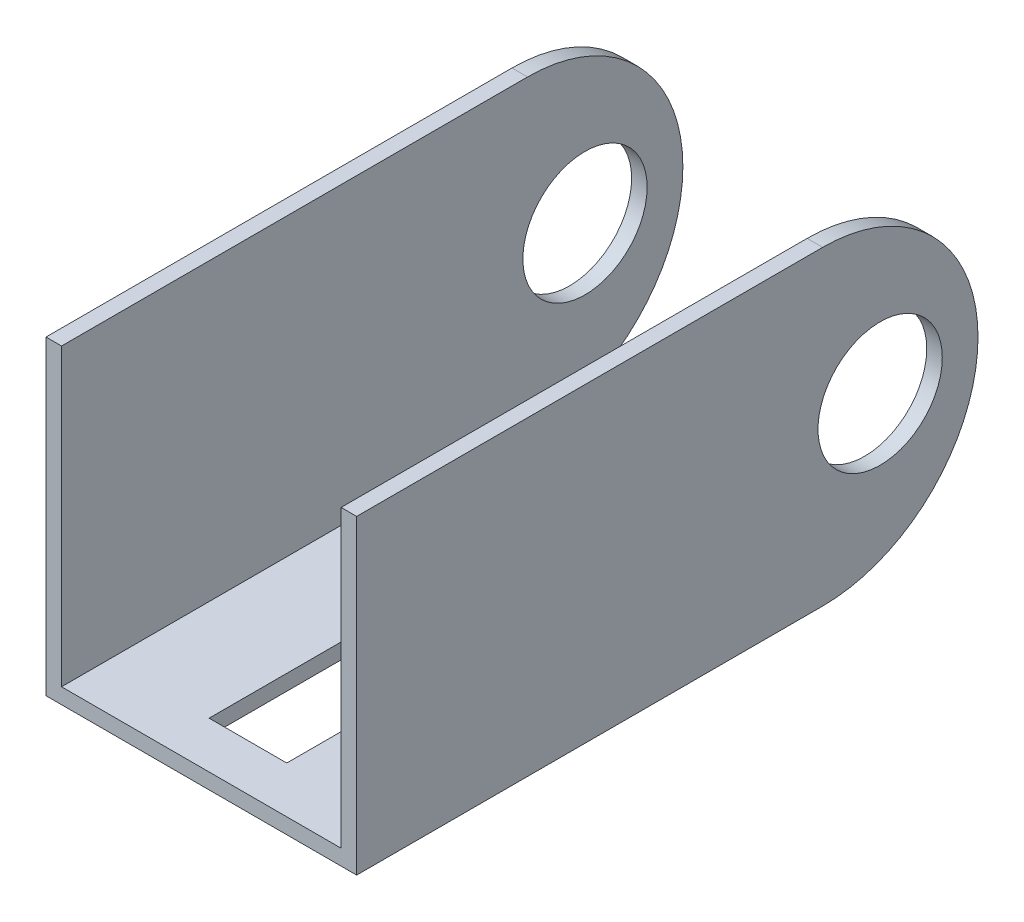
ISO-10303-21;
HEADER;
FILE_DESCRIPTION(('STEP AP214'),'2;1');
FILE_NAME('part.step','',(''),(''),'','','');
FILE_SCHEMA(('AUTOMOTIVE_DESIGN { 1 0 10303 214 1 1 1 1 }'));
ENDSEC;
DATA;
#1=APPLICATION_CONTEXT('core data for automotive mechanical design processes');
#2=APPLICATION_PROTOCOL_DEFINITION('international standard','automotive_design',2000,#1);
#3=PRODUCT_CONTEXT('',#1,'mechanical');
#4=PRODUCT('Part','Part','',(#3));
#5=PRODUCT_RELATED_PRODUCT_CATEGORY('part','',(#4));
#6=PRODUCT_DEFINITION_FORMATION('','',#4);
#7=PRODUCT_DEFINITION_CONTEXT('part definition',#1,'design');
#8=PRODUCT_DEFINITION('design','',#6,#7);
#9=PRODUCT_DEFINITION_SHAPE('','',#8);
#10=(LENGTH_UNIT() NAMED_UNIT(*) SI_UNIT(.MILLI.,.METRE.));
#11=(NAMED_UNIT(*) PLANE_ANGLE_UNIT() SI_UNIT($,.RADIAN.));
#12=(NAMED_UNIT(*) SI_UNIT($,.STERADIAN.) SOLID_ANGLE_UNIT());
#13=UNCERTAINTY_MEASURE_WITH_UNIT(LENGTH_MEASURE(1.E-05),#10,'distance_accuracy_value','');
#14=(GEOMETRIC_REPRESENTATION_CONTEXT(3) GLOBAL_UNCERTAINTY_ASSIGNED_CONTEXT((#13)) GLOBAL_UNIT_ASSIGNED_CONTEXT((#10,
#11,#12)) REPRESENTATION_CONTEXT('',''));
#15=CARTESIAN_POINT('',(0.,0.,0.));
#16=DIRECTION('',(0.,0.,1.));
#17=DIRECTION('',(1.,0.,0.));
#18=AXIS2_PLACEMENT_3D('',#15,#16,#17);
#19=CARTESIAN_POINT('',(-40.,10.,-30.));
#20=DIRECTION('',(1.,0.,0.));
#21=DIRECTION('',(0.,0.,-1.));
#22=AXIS2_PLACEMENT_3D('',#19,#20,#21);
#23=CYLINDRICAL_SURFACE('',#22,10.);
#24=CARTESIAN_POINT('',(-19.,10.,-30.));
#25=DIRECTION('',(1.,0.,0.));
#26=DIRECTION('',(0.,0.,-1.));
#27=AXIS2_PLACEMENT_3D('',#24,#25,#26);
#28=CIRCLE('',#27,10.);
#29=CARTESIAN_POINT('',(-19.,0.,-30.));
#30=VERTEX_POINT('',#29);
#31=CARTESIAN_POINT('',(-19.,20.,-30.));
#32=VERTEX_POINT('',#31);
#33=EDGE_CURVE('E238',#30,#32,#28,.T.);
#34=ORIENTED_EDGE('',*,*,#33,.F.);
#35=DIRECTION('',(1.,0.,0.));
#36=VECTOR('',#35,1.);
#37=CARTESIAN_POINT('',(-40.,0.,-30.));
#38=LINE('',#37,#36);
#39=CARTESIAN_POINT('',(-20.,0.,-30.));
#40=VERTEX_POINT('',#39);
#41=EDGE_CURVE('E226',#40,#30,#38,.T.);
#42=ORIENTED_EDGE('',*,*,#41,.F.);
#43=CARTESIAN_POINT('',(-20.,10.,-30.));
#44=DIRECTION('',(-1.,0.,0.));
#45=DIRECTION('',(0.,0.,1.));
#46=AXIS2_PLACEMENT_3D('',#43,#44,#45);
#47=CIRCLE('',#46,10.);
#48=CARTESIAN_POINT('',(-20.,20.,-30.));
#49=VERTEX_POINT('',#48);
#50=EDGE_CURVE('E241',#49,#40,#47,.T.);
#51=ORIENTED_EDGE('',*,*,#50,.F.);
#52=DIRECTION('',(1.,0.,0.));
#53=VECTOR('',#52,1.);
#54=CARTESIAN_POINT('',(-40.,20.,-30.));
#55=LINE('',#54,#53);
#56=EDGE_CURVE('E237',#49,#32,#55,.T.);
#57=ORIENTED_EDGE('',*,*,#56,.T.);
#58=EDGE_LOOP('',(#34,#42,#51,#57));
#59=FACE_BOUND('',#58,.T.);
#60=ADVANCED_FACE('F58',(#59),#23,.T.);
#61=CARTESIAN_POINT('',(-1.,0.999999999999998,-40.));
#62=DIRECTION('',(-1.,0.,0.));
#63=DIRECTION('',(0.,0.,1.));
#64=AXIS2_PLACEMENT_3D('',#61,#62,#63);
#65=PLANE('',#64);
#66=CARTESIAN_POINT('',(-1.,10.,-33.7));
#67=DIRECTION('',(-1.,0.,0.));
#68=DIRECTION('',(0.,0.,1.));
#69=AXIS2_PLACEMENT_3D('',#66,#67,#68);
#70=CIRCLE('',#69,4.);
#71=CARTESIAN_POINT('',(-1.,10.,-29.7));
#72=VERTEX_POINT('',#71);
#73=EDGE_CURVE('E221',#72,#72,#70,.T.);
#74=ORIENTED_EDGE('',*,*,#73,.F.);
#75=EDGE_LOOP('',(#74));
#76=FACE_BOUND('',#75,.T.);
#77=CARTESIAN_POINT('',(-1.,10.,-30.));
#78=DIRECTION('',(-1.,0.,0.));
#79=DIRECTION('',(0.,0.,1.));
#80=AXIS2_PLACEMENT_3D('',#77,#78,#79);
#81=CIRCLE('',#80,10.);
#82=CARTESIAN_POINT('',(-1.,20.,-30.));
#83=VERTEX_POINT('',#82);
#84=CARTESIAN_POINT('',(-1.,0.,-30.));
#85=VERTEX_POINT('',#84);
#86=EDGE_CURVE('E244',#83,#85,#81,.T.);
#87=ORIENTED_EDGE('',*,*,#86,.T.);
#88=DIRECTION('',(0.,0.,1.));
#89=VECTOR('',#88,1.);
#90=CARTESIAN_POINT('',(-1.,0.,-34.3588989435407));
#91=LINE('',#90,#89);
#92=CARTESIAN_POINT('',(-1.,0.,-26.));
#93=VERTEX_POINT('',#92);
#94=EDGE_CURVE('E198',#85,#93,#91,.T.);
#95=ORIENTED_EDGE('',*,*,#94,.T.);
#96=DIRECTION('',(0.,-1.,0.));
#97=VECTOR('',#96,1.);
#98=CARTESIAN_POINT('',(-1.00000000000001,40.,-26.));
#99=LINE('',#98,#97);
#100=CARTESIAN_POINT('',(-1.,1.,-26.));
#101=VERTEX_POINT('',#100);
#102=EDGE_CURVE('E206',#101,#93,#99,.T.);
#103=ORIENTED_EDGE('',*,*,#102,.F.);
#104=DIRECTION('',(0.,0.,1.));
#105=VECTOR('',#104,1.);
#106=CARTESIAN_POINT('',(-1.,0.999999999999998,-40.));
#107=LINE('',#106,#105);
#108=CARTESIAN_POINT('',(-1.,0.999999999999998,0.));
#109=VERTEX_POINT('',#108);
#110=EDGE_CURVE('E279',#101,#109,#107,.T.);
#111=ORIENTED_EDGE('',*,*,#110,.T.);
#112=DIRECTION('',(0.,-1.,0.));
#113=VECTOR('',#112,1.);
#114=CARTESIAN_POINT('',(-1.,0.999999999999998,0.));
#115=LINE('',#114,#113);
#116=CARTESIAN_POINT('',(-1.,20.,0.));
#117=VERTEX_POINT('',#116);
#118=EDGE_CURVE('E247',#117,#109,#115,.T.);
#119=ORIENTED_EDGE('',*,*,#118,.F.);
#120=DIRECTION('',(0.,0.,1.));
#121=VECTOR('',#120,1.);
#122=CARTESIAN_POINT('',(-1.,20.,-40.));
#123=LINE('',#122,#121);
#124=EDGE_CURVE('E280',#83,#117,#123,.T.);
#125=ORIENTED_EDGE('',*,*,#124,.F.);
#126=EDGE_LOOP('',(#87,#95,#103,#111,#119,#125));
#127=FACE_BOUND('',#126,.T.);
#128=ADVANCED_FACE('F60',(#76,#127),#65,.T.);
#129=CARTESIAN_POINT('',(0.,20.,-40.));
#130=DIRECTION('',(1.,0.,0.));
#131=DIRECTION('',(0.,0.,-1.));
#132=AXIS2_PLACEMENT_3D('',#129,#130,#131);
#133=PLANE('',#132);
#134=CARTESIAN_POINT('',(0.,10.,-33.7));
#135=DIRECTION('',(1.,0.,0.));
#136=DIRECTION('',(0.,0.,-1.));
#137=AXIS2_PLACEMENT_3D('',#134,#135,#136);
#138=CIRCLE('',#137,4.);
#139=CARTESIAN_POINT('',(0.,10.,-37.7));
#140=VERTEX_POINT('',#139);
#141=EDGE_CURVE('E210',#140,#140,#138,.T.);
#142=ORIENTED_EDGE('',*,*,#141,.F.);
#143=EDGE_LOOP('',(#142));
#144=FACE_BOUND('',#143,.T.);
#145=DIRECTION('',(0.,0.,1.));
#146=VECTOR('',#145,1.);
#147=CARTESIAN_POINT('',(0.,0.,-40.));
#148=LINE('',#147,#146);
#149=CARTESIAN_POINT('',(0.,0.,-30.));
#150=VERTEX_POINT('',#149);
#151=CARTESIAN_POINT('',(0.,0.,0.));
#152=VERTEX_POINT('',#151);
#153=EDGE_CURVE('E287',#150,#152,#148,.T.);
#154=ORIENTED_EDGE('',*,*,#153,.F.);
#155=CARTESIAN_POINT('',(0.,10.,-30.));
#156=DIRECTION('',(1.,0.,0.));
#157=DIRECTION('',(0.,0.,-1.));
#158=AXIS2_PLACEMENT_3D('',#155,#156,#157);
#159=CIRCLE('',#158,10.);
#160=CARTESIAN_POINT('',(0.,20.,-30.));
#161=VERTEX_POINT('',#160);
#162=EDGE_CURVE('E230',#150,#161,#159,.T.);
#163=ORIENTED_EDGE('',*,*,#162,.T.);
#164=DIRECTION('',(0.,0.,1.));
#165=VECTOR('',#164,1.);
#166=CARTESIAN_POINT('',(0.,20.,-40.));
#167=LINE('',#166,#165);
#168=CARTESIAN_POINT('',(0.,20.,0.));
#169=VERTEX_POINT('',#168);
#170=EDGE_CURVE('E284',#161,#169,#167,.T.);
#171=ORIENTED_EDGE('',*,*,#170,.T.);
#172=DIRECTION('',(0.,1.,0.));
#173=VECTOR('',#172,1.);
#174=CARTESIAN_POINT('',(0.,20.,0.));
#175=LINE('',#174,#173);
#176=EDGE_CURVE('E271',#152,#169,#175,.T.);
#177=ORIENTED_EDGE('',*,*,#176,.F.);
#178=EDGE_LOOP('',(#154,#163,#171,#177));
#179=FACE_BOUND('',#178,.T.);
#180=ADVANCED_FACE('F343',(#144,#179),#133,.T.);
#181=CARTESIAN_POINT('',(-20.,0.,-40.));
#182=DIRECTION('',(-1.,0.,0.));
#183=DIRECTION('',(0.,0.,1.));
#184=AXIS2_PLACEMENT_3D('',#181,#182,#183);
#185=PLANE('',#184);
#186=CARTESIAN_POINT('',(-20.,10.,-33.7));
#187=DIRECTION('',(-1.,0.,0.));
#188=DIRECTION('',(0.,0.,1.));
#189=AXIS2_PLACEMENT_3D('',#186,#187,#188);
#190=CIRCLE('',#189,4.);
#191=CARTESIAN_POINT('',(-20.,10.,-29.7));
#192=VERTEX_POINT('',#191);
#193=EDGE_CURVE('E217',#192,#192,#190,.T.);
#194=ORIENTED_EDGE('',*,*,#193,.F.);
#195=EDGE_LOOP('',(#194));
#196=FACE_BOUND('',#195,.T.);
#197=ORIENTED_EDGE('',*,*,#50,.T.);
#198=DIRECTION('',(0.,0.,1.));
#199=VECTOR('',#198,1.);
#200=CARTESIAN_POINT('',(-20.,0.,-40.));
#201=LINE('',#200,#199);
#202=CARTESIAN_POINT('',(-20.,0.,0.));
#203=VERTEX_POINT('',#202);
#204=EDGE_CURVE('E290',#40,#203,#201,.T.);
#205=ORIENTED_EDGE('',*,*,#204,.T.);
#206=DIRECTION('',(0.,-1.,0.));
#207=VECTOR('',#206,1.);
#208=CARTESIAN_POINT('',(-20.,0.,0.));
#209=LINE('',#208,#207);
#210=CARTESIAN_POINT('',(-20.,20.,0.));
#211=VERTEX_POINT('',#210);
#212=EDGE_CURVE('E263',#211,#203,#209,.T.);
#213=ORIENTED_EDGE('',*,*,#212,.F.);
#214=DIRECTION('',(0.,0.,1.));
#215=VECTOR('',#214,1.);
#216=CARTESIAN_POINT('',(-20.,20.,-40.));
#217=LINE('',#216,#215);
#218=EDGE_CURVE('E293',#49,#211,#217,.T.);
#219=ORIENTED_EDGE('',*,*,#218,.F.);
#220=EDGE_LOOP('',(#197,#205,#213,#219));
#221=FACE_BOUND('',#220,.T.);
#222=ADVANCED_FACE('F382',(#196,#221),#185,.T.);
#223=CARTESIAN_POINT('',(-19.,20.,-40.));
#224=DIRECTION('',(1.,0.,0.));
#225=DIRECTION('',(0.,0.,-1.));
#226=AXIS2_PLACEMENT_3D('',#223,#224,#225);
#227=PLANE('',#226);
#228=CARTESIAN_POINT('',(-19.,10.,-33.7));
#229=DIRECTION('',(1.,0.,0.));
#230=DIRECTION('',(0.,0.,-1.));
#231=AXIS2_PLACEMENT_3D('',#228,#229,#230);
#232=CIRCLE('',#231,4.);
#233=CARTESIAN_POINT('',(-19.,10.,-37.7));
#234=VERTEX_POINT('',#233);
#235=EDGE_CURVE('E216',#234,#234,#232,.T.);
#236=ORIENTED_EDGE('',*,*,#235,.F.);
#237=EDGE_LOOP('',(#236));
#238=FACE_BOUND('',#237,.T.);
#239=DIRECTION('',(0.,0.,-1.));
#240=VECTOR('',#239,1.);
#241=CARTESIAN_POINT('',(-19.,0.,-26.));
#242=LINE('',#241,#240);
#243=CARTESIAN_POINT('',(-19.,0.,-26.));
#244=VERTEX_POINT('',#243);
#245=EDGE_CURVE('E190',#244,#30,#242,.T.);
#246=ORIENTED_EDGE('',*,*,#245,.T.);
#247=ORIENTED_EDGE('',*,*,#33,.T.);
#248=DIRECTION('',(0.,0.,1.));
#249=VECTOR('',#248,1.);
#250=CARTESIAN_POINT('',(-19.,20.,-40.));
#251=LINE('',#250,#249);
#252=CARTESIAN_POINT('',(-19.,20.,0.));
#253=VERTEX_POINT('',#252);
#254=EDGE_CURVE('E296',#32,#253,#251,.T.);
#255=ORIENTED_EDGE('',*,*,#254,.T.);
#256=DIRECTION('',(0.,1.,0.));
#257=VECTOR('',#256,1.);
#258=CARTESIAN_POINT('',(-19.,20.,0.));
#259=LINE('',#258,#257);
#260=CARTESIAN_POINT('',(-19.,0.999999999999997,0.));
#261=VERTEX_POINT('',#260);
#262=EDGE_CURVE('E255',#261,#253,#259,.T.);
#263=ORIENTED_EDGE('',*,*,#262,.F.);
#264=DIRECTION('',(0.,0.,1.));
#265=VECTOR('',#264,1.);
#266=CARTESIAN_POINT('',(-19.,0.999999999999997,-40.));
#267=LINE('',#266,#265);
#268=CARTESIAN_POINT('',(-19.,1.,-26.));
#269=VERTEX_POINT('',#268);
#270=EDGE_CURVE('E299',#269,#261,#267,.T.);
#271=ORIENTED_EDGE('',*,*,#270,.F.);
#272=DIRECTION('',(0.,-1.,0.));
#273=VECTOR('',#272,1.);
#274=CARTESIAN_POINT('',(-19.,40.,-26.));
#275=LINE('',#274,#273);
#276=EDGE_CURVE('E207',#269,#244,#275,.T.);
#277=ORIENTED_EDGE('',*,*,#276,.T.);
#278=EDGE_LOOP('',(#246,#247,#255,#263,#271,#277));
#279=FACE_BOUND('',#278,.T.);
#280=ADVANCED_FACE('F374',(#238,#279),#227,.T.);
#281=CARTESIAN_POINT('',(0.,0.,-40.));
#282=DIRECTION('',(0.,-1.,0.));
#283=DIRECTION('',(1.,0.,0.));
#284=AXIS2_PLACEMENT_3D('',#281,#282,#283);
#285=PLANE('',#284);
#286=DIRECTION('',(0.,0.,1.));
#287=VECTOR('',#286,1.);
#288=CARTESIAN_POINT('',(-7.5,0.,-22.));
#289=LINE('',#288,#287);
#290=CARTESIAN_POINT('',(-7.5,0.,-22.));
#291=VERTEX_POINT('',#290);
#292=CARTESIAN_POINT('',(-7.5,0.,-3.));
#293=VERTEX_POINT('',#292);
#294=EDGE_CURVE('E74',#291,#293,#289,.T.);
#295=ORIENTED_EDGE('',*,*,#294,.F.);
#296=DIRECTION('',(1.,0.,0.));
#297=VECTOR('',#296,1.);
#298=CARTESIAN_POINT('',(-7.5,0.,-22.));
#299=LINE('',#298,#297);
#300=CARTESIAN_POINT('',(-12.5,0.,-22.));
#301=VERTEX_POINT('',#300);
#302=EDGE_CURVE('E180',#301,#291,#299,.T.);
#303=ORIENTED_EDGE('',*,*,#302,.F.);
#304=DIRECTION('',(0.,0.,-1.));
#305=VECTOR('',#304,1.);
#306=CARTESIAN_POINT('',(-12.5,0.,-22.));
#307=LINE('',#306,#305);
#308=CARTESIAN_POINT('',(-12.5,0.,-3.));
#309=VERTEX_POINT('',#308);
#310=EDGE_CURVE('E162',#309,#301,#307,.T.);
#311=ORIENTED_EDGE('',*,*,#310,.F.);
#312=DIRECTION('',(-1.,0.,0.));
#313=VECTOR('',#312,1.);
#314=CARTESIAN_POINT('',(-7.5,0.,-3.));
#315=LINE('',#314,#313);
#316=EDGE_CURVE('E172',#293,#309,#315,.T.);
#317=ORIENTED_EDGE('',*,*,#316,.F.);
#318=EDGE_LOOP('',(#295,#303,#311,#317));
#319=FACE_BOUND('',#318,.T.);
#320=ORIENTED_EDGE('',*,*,#245,.F.);
#321=DIRECTION('',(-1.,0.,0.));
#322=VECTOR('',#321,1.);
#323=CARTESIAN_POINT('',(-19.,0.,-26.));
#324=LINE('',#323,#322);
#325=EDGE_CURVE('E202',#93,#244,#324,.T.);
#326=ORIENTED_EDGE('',*,*,#325,.F.);
#327=ORIENTED_EDGE('',*,*,#94,.F.);
#328=EDGE_CURVE('E225',#85,#150,#38,.T.);
#329=ORIENTED_EDGE('',*,*,#328,.T.);
#330=ORIENTED_EDGE('',*,*,#153,.T.);
#331=DIRECTION('',(1.,0.,0.));
#332=VECTOR('',#331,1.);
#333=CARTESIAN_POINT('',(0.,0.,0.));
#334=LINE('',#333,#332);
#335=EDGE_CURVE('E267',#203,#152,#334,.T.);
#336=ORIENTED_EDGE('',*,*,#335,.F.);
#337=ORIENTED_EDGE('',*,*,#204,.F.);
#338=ORIENTED_EDGE('',*,*,#41,.T.);
#339=EDGE_LOOP('',(#320,#326,#327,#329,#330,#336,#337,#338));
#340=FACE_BOUND('',#339,.T.);
#341=ADVANCED_FACE('F177',(#319,#340),#285,.T.);
#342=CARTESIAN_POINT('',(-19.,0.999999999999997,-40.));
#343=DIRECTION('',(0.,1.,0.));
#344=DIRECTION('',(-1.,0.,0.));
#345=AXIS2_PLACEMENT_3D('',#342,#343,#344);
#346=PLANE('',#345);
#347=DIRECTION('',(0.,0.,-1.));
#348=VECTOR('',#347,1.);
#349=CARTESIAN_POINT('',(-7.5,0.999999999999998,-40.));
#350=LINE('',#349,#348);
#351=CARTESIAN_POINT('',(-7.5,1.,-3.));
#352=VERTEX_POINT('',#351);
#353=CARTESIAN_POINT('',(-7.5,1.,-22.));
#354=VERTEX_POINT('',#353);
#355=EDGE_CURVE('E12',#352,#354,#350,.T.);
#356=ORIENTED_EDGE('',*,*,#355,.F.);
#357=DIRECTION('',(1.,0.,0.));
#358=VECTOR('',#357,1.);
#359=CARTESIAN_POINT('',(-19.,0.999999999999997,-3.));
#360=LINE('',#359,#358);
#361=CARTESIAN_POINT('',(-12.5,0.999999999999998,-3.));
#362=VERTEX_POINT('',#361);
#363=EDGE_CURVE('E309',#362,#352,#360,.T.);
#364=ORIENTED_EDGE('',*,*,#363,.F.);
#365=DIRECTION('',(0.,0.,1.));
#366=VECTOR('',#365,1.);
#367=CARTESIAN_POINT('',(-12.5,0.999999999999998,-40.));
#368=LINE('',#367,#366);
#369=CARTESIAN_POINT('',(-12.5,1.,-22.));
#370=VERTEX_POINT('',#369);
#371=EDGE_CURVE('E165',#370,#362,#368,.T.);
#372=ORIENTED_EDGE('',*,*,#371,.F.);
#373=DIRECTION('',(-1.,0.,0.));
#374=VECTOR('',#373,1.);
#375=CARTESIAN_POINT('',(-19.,0.999999999999997,-22.));
#376=LINE('',#375,#374);
#377=EDGE_CURVE('E67',#354,#370,#376,.T.);
#378=ORIENTED_EDGE('',*,*,#377,.F.);
#379=EDGE_LOOP('',(#356,#364,#372,#378));
#380=FACE_BOUND('',#379,.T.);
#381=DIRECTION('',(1.,0.,0.));
#382=VECTOR('',#381,1.);
#383=CARTESIAN_POINT('',(-19.,0.999999999999997,-26.));
#384=LINE('',#383,#382);
#385=EDGE_CURVE('E283',#269,#101,#384,.T.);
#386=ORIENTED_EDGE('',*,*,#385,.F.);
#387=ORIENTED_EDGE('',*,*,#270,.T.);
#388=DIRECTION('',(-1.,0.,0.));
#389=VECTOR('',#388,1.);
#390=CARTESIAN_POINT('',(-19.,0.999999999999997,0.));
#391=LINE('',#390,#389);
#392=EDGE_CURVE('E251',#109,#261,#391,.T.);
#393=ORIENTED_EDGE('',*,*,#392,.F.);
#394=ORIENTED_EDGE('',*,*,#110,.F.);
#395=EDGE_LOOP('',(#386,#387,#393,#394));
#396=FACE_BOUND('',#395,.T.);
#397=ADVANCED_FACE('F320',(#380,#396),#346,.T.);
#398=CARTESIAN_POINT('',(-1.,20.,-40.));
#399=DIRECTION('',(0.,1.,0.));
#400=DIRECTION('',(0.,0.,1.));
#401=AXIS2_PLACEMENT_3D('',#398,#399,#400);
#402=PLANE('',#401);
#403=EDGE_CURVE('E234',#83,#161,#55,.T.);
#404=ORIENTED_EDGE('',*,*,#403,.F.);
#405=ORIENTED_EDGE('',*,*,#124,.T.);
#406=DIRECTION('',(-1.,0.,0.));
#407=VECTOR('',#406,1.);
#408=CARTESIAN_POINT('',(-1.,20.,0.));
#409=LINE('',#408,#407);
#410=EDGE_CURVE('E275',#169,#117,#409,.T.);
#411=ORIENTED_EDGE('',*,*,#410,.F.);
#412=ORIENTED_EDGE('',*,*,#170,.F.);
#413=EDGE_LOOP('',(#404,#405,#411,#412));
#414=FACE_BOUND('',#413,.T.);
#415=ADVANCED_FACE('F392',(#414),#402,.T.);
#416=CARTESIAN_POINT('',(-20.,20.,-40.));
#417=DIRECTION('',(0.,1.,0.));
#418=DIRECTION('',(0.,0.,1.));
#419=AXIS2_PLACEMENT_3D('',#416,#417,#418);
#420=PLANE('',#419);
#421=ORIENTED_EDGE('',*,*,#56,.F.);
#422=ORIENTED_EDGE('',*,*,#218,.T.);
#423=DIRECTION('',(-1.,0.,0.));
#424=VECTOR('',#423,1.);
#425=CARTESIAN_POINT('',(-20.,20.,0.));
#426=LINE('',#425,#424);
#427=EDGE_CURVE('E259',#253,#211,#426,.T.);
#428=ORIENTED_EDGE('',*,*,#427,.F.);
#429=ORIENTED_EDGE('',*,*,#254,.F.);
#430=EDGE_LOOP('',(#421,#422,#428,#429));
#431=FACE_BOUND('',#430,.T.);
#432=ADVANCED_FACE('F356',(#431),#420,.T.);
#433=CARTESIAN_POINT('',(0.,0.,0.));
#434=DIRECTION('',(0.,0.,-1.));
#435=DIRECTION('',(-1.,0.,0.));
#436=AXIS2_PLACEMENT_3D('',#433,#434,#435);
#437=PLANE('',#436);
#438=ORIENTED_EDGE('',*,*,#118,.T.);
#439=ORIENTED_EDGE('',*,*,#392,.T.);
#440=ORIENTED_EDGE('',*,*,#262,.T.);
#441=ORIENTED_EDGE('',*,*,#427,.T.);
#442=ORIENTED_EDGE('',*,*,#212,.T.);
#443=ORIENTED_EDGE('',*,*,#335,.T.);
#444=ORIENTED_EDGE('',*,*,#176,.T.);
#445=ORIENTED_EDGE('',*,*,#410,.T.);
#446=EDGE_LOOP('',(#438,#439,#440,#441,#442,#443,#444,#445));
#447=FACE_BOUND('',#446,.T.);
#448=ADVANCED_FACE('F349',(#447),#437,.F.);
#449=ORIENTED_EDGE('',*,*,#328,.F.);
#450=ORIENTED_EDGE('',*,*,#86,.F.);
#451=ORIENTED_EDGE('',*,*,#403,.T.);
#452=ORIENTED_EDGE('',*,*,#162,.F.);
#453=EDGE_LOOP('',(#449,#450,#451,#452));
#454=FACE_BOUND('',#453,.T.);
#455=ADVANCED_FACE('F339',(#454),#23,.T.);
#456=CARTESIAN_POINT('',(-40.,10.,-33.7));
#457=DIRECTION('',(1.,0.,0.));
#458=DIRECTION('',(0.,0.,-1.));
#459=AXIS2_PLACEMENT_3D('',#456,#457,#458);
#460=CYLINDRICAL_SURFACE('',#459,4.);
#461=ORIENTED_EDGE('',*,*,#193,.T.);
#462=EDGE_LOOP('',(#461));
#463=FACE_BOUND('',#462,.T.);
#464=ORIENTED_EDGE('',*,*,#235,.T.);
#465=EDGE_LOOP('',(#464));
#466=FACE_BOUND('',#465,.T.);
#467=ADVANCED_FACE('F348',(#463,#466),#460,.F.);
#468=ORIENTED_EDGE('',*,*,#73,.T.);
#469=EDGE_LOOP('',(#468));
#470=FACE_BOUND('',#469,.T.);
#471=ORIENTED_EDGE('',*,*,#141,.T.);
#472=EDGE_LOOP('',(#471));
#473=FACE_BOUND('',#472,.T.);
#474=ADVANCED_FACE('F332',(#470,#473),#460,.F.);
#475=CARTESIAN_POINT('',(-19.,40.,-26.));
#476=DIRECTION('',(0.,0.,1.));
#477=DIRECTION('',(1.,0.,0.));
#478=AXIS2_PLACEMENT_3D('',#475,#476,#477);
#479=PLANE('',#478);
#480=ORIENTED_EDGE('',*,*,#385,.T.);
#481=ORIENTED_EDGE('',*,*,#102,.T.);
#482=ORIENTED_EDGE('',*,*,#325,.T.);
#483=ORIENTED_EDGE('',*,*,#276,.F.);
#484=EDGE_LOOP('',(#480,#481,#482,#483));
#485=FACE_BOUND('',#484,.T.);
#486=ADVANCED_FACE('F325',(#485),#479,.F.);
#487=CARTESIAN_POINT('',(-7.50000000000001,40.,-22.));
#488=DIRECTION('',(1.,0.,0.));
#489=DIRECTION('',(0.,1.,0.));
#490=AXIS2_PLACEMENT_3D('',#487,#488,#489);
#491=PLANE('',#490);
#492=ORIENTED_EDGE('',*,*,#355,.T.);
#493=DIRECTION('',(0.,-1.,0.));
#494=VECTOR('',#493,1.);
#495=CARTESIAN_POINT('',(-7.50000000000001,40.,-22.));
#496=LINE('',#495,#494);
#497=EDGE_CURVE('E187',#354,#291,#496,.T.);
#498=ORIENTED_EDGE('',*,*,#497,.T.);
#499=ORIENTED_EDGE('',*,*,#294,.T.);
#500=DIRECTION('',(0.,-1.,0.));
#501=VECTOR('',#500,1.);
#502=CARTESIAN_POINT('',(-7.50000000000001,40.,-3.));
#503=LINE('',#502,#501);
#504=EDGE_CURVE('E169',#352,#293,#503,.T.);
#505=ORIENTED_EDGE('',*,*,#504,.F.);
#506=EDGE_LOOP('',(#492,#498,#499,#505));
#507=FACE_BOUND('',#506,.T.);
#508=ADVANCED_FACE('F322',(#507),#491,.F.);
#509=CARTESIAN_POINT('',(-7.50000000000001,40.,-22.));
#510=DIRECTION('',(0.,0.,-1.));
#511=DIRECTION('',(-1.,0.,0.));
#512=AXIS2_PLACEMENT_3D('',#509,#510,#511);
#513=PLANE('',#512);
#514=ORIENTED_EDGE('',*,*,#377,.T.);
#515=DIRECTION('',(0.,-1.,0.));
#516=VECTOR('',#515,1.);
#517=CARTESIAN_POINT('',(-12.5,40.,-22.));
#518=LINE('',#517,#516);
#519=EDGE_CURVE('E168',#370,#301,#518,.T.);
#520=ORIENTED_EDGE('',*,*,#519,.T.);
#521=ORIENTED_EDGE('',*,*,#302,.T.);
#522=ORIENTED_EDGE('',*,*,#497,.F.);
#523=EDGE_LOOP('',(#514,#520,#521,#522));
#524=FACE_BOUND('',#523,.T.);
#525=ADVANCED_FACE('F317',(#524),#513,.F.);
#526=CARTESIAN_POINT('',(-12.5,40.,-22.));
#527=DIRECTION('',(-1.,0.,0.));
#528=DIRECTION('',(0.,-1.,0.));
#529=AXIS2_PLACEMENT_3D('',#526,#527,#528);
#530=PLANE('',#529);
#531=ORIENTED_EDGE('',*,*,#371,.T.);
#532=DIRECTION('',(0.,-1.,0.));
#533=VECTOR('',#532,1.);
#534=CARTESIAN_POINT('',(-12.5,40.,-3.));
#535=LINE('',#534,#533);
#536=EDGE_CURVE('E82',#362,#309,#535,.T.);
#537=ORIENTED_EDGE('',*,*,#536,.T.);
#538=ORIENTED_EDGE('',*,*,#310,.T.);
#539=ORIENTED_EDGE('',*,*,#519,.F.);
#540=EDGE_LOOP('',(#531,#537,#538,#539));
#541=FACE_BOUND('',#540,.T.);
#542=ADVANCED_FACE('F159',(#541),#530,.F.);
#543=CARTESIAN_POINT('',(-7.50000000000001,40.,-3.));
#544=DIRECTION('',(0.,0.,1.));
#545=DIRECTION('',(1.,0.,0.));
#546=AXIS2_PLACEMENT_3D('',#543,#544,#545);
#547=PLANE('',#546);
#548=ORIENTED_EDGE('',*,*,#363,.T.);
#549=ORIENTED_EDGE('',*,*,#504,.T.);
#550=ORIENTED_EDGE('',*,*,#316,.T.);
#551=ORIENTED_EDGE('',*,*,#536,.F.);
#552=EDGE_LOOP('',(#548,#549,#550,#551));
#553=FACE_BOUND('',#552,.T.);
#554=ADVANCED_FACE('F173',(#553),#547,.F.);
#555=CLOSED_SHELL('',(#60,#128,#180,#222,#280,#341,#397,#415,#432,#448,#455,#467,#474,#486,#508,
#525,#542,#554));
#556=MANIFOLD_SOLID_BREP('B2',#555);
#557=ADVANCED_BREP_SHAPE_REPRESENTATION('',(#18,#556),#14);
#558=SHAPE_DEFINITION_REPRESENTATION(#9,#557);
ENDSEC;
END-ISO-10303-21;
